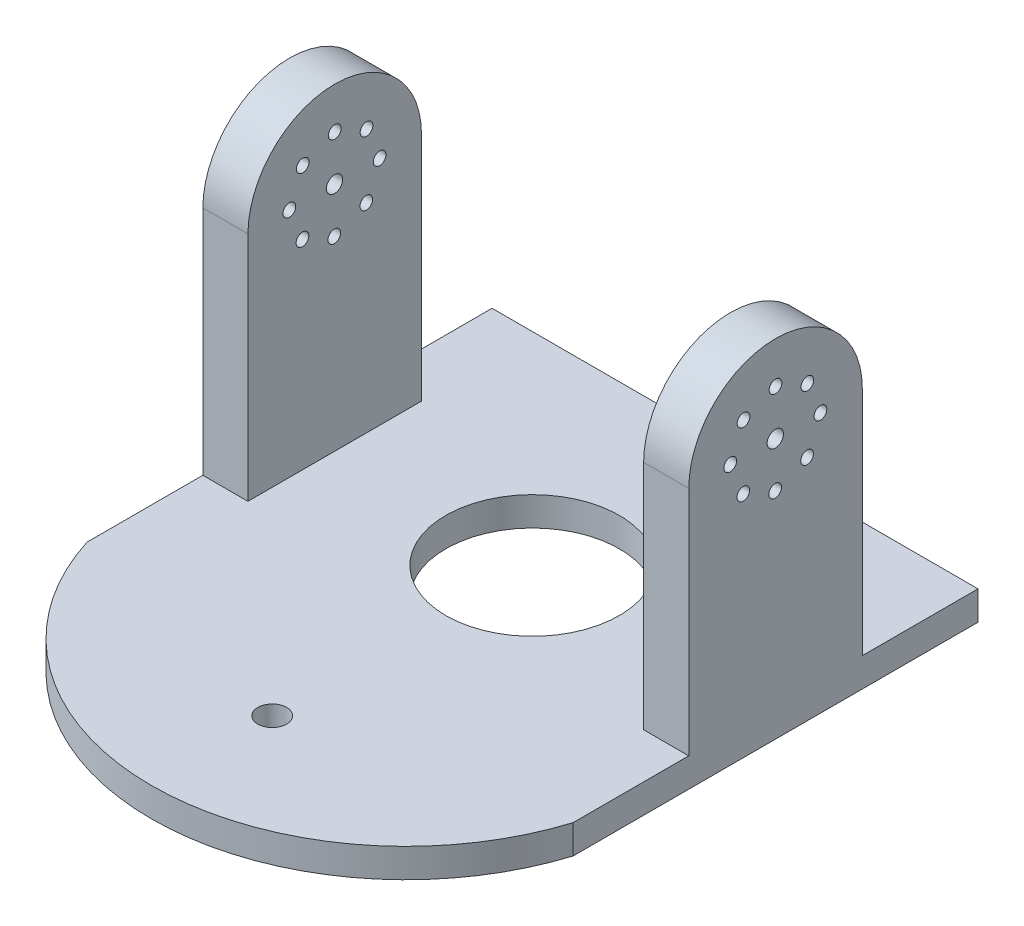
ISO-10303-21;
HEADER;
FILE_DESCRIPTION(('STEP AP214'),'2;1');
FILE_NAME('part.step','',(''),(''),'','','');
FILE_SCHEMA(('AUTOMOTIVE_DESIGN { 1 0 10303 214 1 1 1 1 }'));
ENDSEC;
DATA;
#1=APPLICATION_CONTEXT('core data for automotive mechanical design processes');
#2=APPLICATION_PROTOCOL_DEFINITION('international standard','automotive_design',2000,#1);
#3=PRODUCT_CONTEXT('',#1,'mechanical');
#4=PRODUCT('Part','Part','',(#3));
#5=PRODUCT_RELATED_PRODUCT_CATEGORY('part','',(#4));
#6=PRODUCT_DEFINITION_FORMATION('','',#4);
#7=PRODUCT_DEFINITION_CONTEXT('part definition',#1,'design');
#8=PRODUCT_DEFINITION('design','',#6,#7);
#9=PRODUCT_DEFINITION_SHAPE('','',#8);
#10=(LENGTH_UNIT() NAMED_UNIT(*) SI_UNIT(.MILLI.,.METRE.));
#11=(NAMED_UNIT(*) PLANE_ANGLE_UNIT() SI_UNIT($,.RADIAN.));
#12=(NAMED_UNIT(*) SI_UNIT($,.STERADIAN.) SOLID_ANGLE_UNIT());
#13=UNCERTAINTY_MEASURE_WITH_UNIT(LENGTH_MEASURE(1.E-05),#10,'distance_accuracy_value','');
#14=(GEOMETRIC_REPRESENTATION_CONTEXT(3) GLOBAL_UNCERTAINTY_ASSIGNED_CONTEXT((#13)) GLOBAL_UNIT_ASSIGNED_CONTEXT((#10,
#11,#12)) REPRESENTATION_CONTEXT('',''));
#15=CARTESIAN_POINT('',(0.,0.,0.));
#16=DIRECTION('',(0.,0.,1.));
#17=DIRECTION('',(1.,0.,0.));
#18=AXIS2_PLACEMENT_3D('',#15,#16,#17);
#19=CARTESIAN_POINT('',(-0.163176772911526,6.35,27.7941061482729));
#20=DIRECTION('',(0.,-1.,0.));
#21=DIRECTION('',(0.,0.,-1.));
#22=AXIS2_PLACEMENT_3D('',#19,#20,#21);
#23=PLANE('',#22);
#24=CARTESIAN_POINT('',(-0.163176772911548,6.35,0.));
#25=DIRECTION('',(0.,1.,0.));
#26=DIRECTION('',(0.,0.,1.));
#27=AXIS2_PLACEMENT_3D('',#24,#25,#26);
#28=CIRCLE('',#27,19.05);
#29=CARTESIAN_POINT('',(-0.163176772911548,6.35,19.05));
#30=VERTEX_POINT('',#29);
#31=EDGE_CURVE('E323',#30,#30,#28,.T.);
#32=ORIENTED_EDGE('',*,*,#31,.F.);
#33=EDGE_LOOP('',(#32));
#34=FACE_BOUND('',#33,.T.);
#35=CARTESIAN_POINT('',(-0.163176772911541,6.35,57.15));
#36=DIRECTION('',(0.,1.,0.));
#37=DIRECTION('',(0.,0.,1.));
#38=AXIS2_PLACEMENT_3D('',#35,#36,#37);
#39=CIRCLE('',#38,3.17499999999999);
#40=CARTESIAN_POINT('',(-0.163176772911541,6.35,60.325));
#41=VERTEX_POINT('',#40);
#42=EDGE_CURVE('E333',#41,#41,#39,.T.);
#43=ORIENTED_EDGE('',*,*,#42,.F.);
#44=EDGE_LOOP('',(#43));
#45=FACE_BOUND('',#44,.T.);
#46=DIRECTION('',(-1.,0.,0.));
#47=VECTOR('',#46,1.);
#48=CARTESIAN_POINT('',(53.1768232270885,6.35,-19.0500000000001));
#49=LINE('',#48,#47);
#50=CARTESIAN_POINT('',(53.1768232270885,6.35,-19.0500000000001));
#51=VERTEX_POINT('',#50);
#52=CARTESIAN_POINT('',(43.2708232270884,6.35,-19.0500000000001));
#53=VERTEX_POINT('',#52);
#54=EDGE_CURVE('E275',#51,#53,#49,.T.);
#55=ORIENTED_EDGE('',*,*,#54,.F.);
#56=DIRECTION('',(0.,0.,-1.));
#57=VECTOR('',#56,1.);
#58=CARTESIAN_POINT('',(53.1768232270885,6.35,-44.45));
#59=LINE('',#58,#57);
#60=CARTESIAN_POINT('',(53.1768232270885,6.35,-44.45));
#61=VERTEX_POINT('',#60);
#62=EDGE_CURVE('E287',#51,#61,#59,.T.);
#63=ORIENTED_EDGE('',*,*,#62,.T.);
#64=DIRECTION('',(-1.,0.,0.));
#65=VECTOR('',#64,1.);
#66=CARTESIAN_POINT('',(-53.5031767729115,6.35,-44.45));
#67=LINE('',#66,#65);
#68=CARTESIAN_POINT('',(-53.5031767729115,6.35,-44.45));
#69=VERTEX_POINT('',#68);
#70=EDGE_CURVE('E293',#61,#69,#67,.T.);
#71=ORIENTED_EDGE('',*,*,#70,.T.);
#72=DIRECTION('',(0.,0.,1.));
#73=VECTOR('',#72,1.);
#74=CARTESIAN_POINT('',(-53.5031767729115,6.35,-44.45));
#75=LINE('',#74,#73);
#76=CARTESIAN_POINT('',(-53.5031767729115,6.35,-19.05));
#77=VERTEX_POINT('',#76);
#78=EDGE_CURVE('E309',#69,#77,#75,.T.);
#79=ORIENTED_EDGE('',*,*,#78,.T.);
#80=DIRECTION('',(-1.,0.,0.));
#81=VECTOR('',#80,1.);
#82=CARTESIAN_POINT('',(-53.5031767729115,6.35,-19.05));
#83=LINE('',#82,#81);
#84=CARTESIAN_POINT('',(-43.5971767729116,6.35,-19.05));
#85=VERTEX_POINT('',#84);
#86=EDGE_CURVE('E159',#85,#77,#83,.T.);
#87=ORIENTED_EDGE('',*,*,#86,.F.);
#88=DIRECTION('',(0.,0.,-1.));
#89=VECTOR('',#88,1.);
#90=CARTESIAN_POINT('',(-43.5971767729116,6.35,-19.05));
#91=LINE('',#90,#89);
#92=CARTESIAN_POINT('',(-43.5971767729116,6.35,19.05));
#93=VERTEX_POINT('',#92);
#94=EDGE_CURVE('E156',#93,#85,#91,.T.);
#95=ORIENTED_EDGE('',*,*,#94,.F.);
#96=DIRECTION('',(1.,0.,0.));
#97=VECTOR('',#96,1.);
#98=CARTESIAN_POINT('',(-53.5031767729115,6.35,19.05));
#99=LINE('',#98,#97);
#100=CARTESIAN_POINT('',(-53.5031767729115,6.35,19.05));
#101=VERTEX_POINT('',#100);
#102=EDGE_CURVE('E155',#101,#93,#99,.T.);
#103=ORIENTED_EDGE('',*,*,#102,.F.);
#104=CARTESIAN_POINT('',(-53.5031767729115,6.35,44.45));
#105=VERTEX_POINT('',#104);
#106=EDGE_CURVE('E300',#101,#105,#75,.T.);
#107=ORIENTED_EDGE('',*,*,#106,.T.);
#108=CARTESIAN_POINT('',(-0.163176772911526,6.35,27.7941061482729));
#109=DIRECTION('',(0.,1.,0.));
#110=DIRECTION('',(0.,0.,-1.));
#111=AXIS2_PLACEMENT_3D('',#108,#109,#110);
#112=CIRCLE('',#111,55.88);
#113=CARTESIAN_POINT('',(53.1768232270885,6.35,44.45));
#114=VERTEX_POINT('',#113);
#115=EDGE_CURVE('E291',#105,#114,#112,.T.);
#116=ORIENTED_EDGE('',*,*,#115,.T.);
#117=CARTESIAN_POINT('',(53.1768232270885,6.35,19.0499999999999));
#118=VERTEX_POINT('',#117);
#119=EDGE_CURVE('E290',#114,#118,#59,.T.);
#120=ORIENTED_EDGE('',*,*,#119,.T.);
#121=DIRECTION('',(1.,0.,0.));
#122=VECTOR('',#121,1.);
#123=CARTESIAN_POINT('',(53.1768232270885,6.35,19.0499999999999));
#124=LINE('',#123,#122);
#125=CARTESIAN_POINT('',(43.2708232270884,6.35,19.0499999999999));
#126=VERTEX_POINT('',#125);
#127=EDGE_CURVE('E144',#126,#118,#124,.T.);
#128=ORIENTED_EDGE('',*,*,#127,.F.);
#129=DIRECTION('',(0.,0.,1.));
#130=VECTOR('',#129,1.);
#131=CARTESIAN_POINT('',(43.2708232270884,6.35,-19.0500000000001));
#132=LINE('',#131,#130);
#133=EDGE_CURVE('E149',#53,#126,#132,.T.);
#134=ORIENTED_EDGE('',*,*,#133,.F.);
#135=EDGE_LOOP('',(#55,#63,#71,#79,#87,#95,#103,#107,#116,#120,#128,#134));
#136=FACE_BOUND('',#135,.T.);
#137=ADVANCED_FACE('F33',(#34,#45,#136),#23,.F.);
#138=CARTESIAN_POINT('',(-0.163176772911526,0.,27.7941061482729));
#139=DIRECTION('',(0.,-1.,0.));
#140=DIRECTION('',(0.,0.,-1.));
#141=AXIS2_PLACEMENT_3D('',#138,#139,#140);
#142=PLANE('',#141);
#143=CARTESIAN_POINT('',(-0.163176772911548,0.,0.));
#144=DIRECTION('',(0.,1.,0.));
#145=DIRECTION('',(0.,0.,1.));
#146=AXIS2_PLACEMENT_3D('',#143,#144,#145);
#147=CIRCLE('',#146,19.05);
#148=CARTESIAN_POINT('',(-0.163176772911548,0.,19.05));
#149=VERTEX_POINT('',#148);
#150=EDGE_CURVE('E328',#149,#149,#147,.T.);
#151=ORIENTED_EDGE('',*,*,#150,.T.);
#152=EDGE_LOOP('',(#151));
#153=FACE_BOUND('',#152,.T.);
#154=CARTESIAN_POINT('',(-0.163176772911526,0.,27.7941061482729));
#155=DIRECTION('',(0.,1.,0.));
#156=DIRECTION('',(0.,0.,-1.));
#157=AXIS2_PLACEMENT_3D('',#154,#155,#156);
#158=CIRCLE('',#157,55.88);
#159=CARTESIAN_POINT('',(-53.5031767729115,0.,44.45));
#160=VERTEX_POINT('',#159);
#161=CARTESIAN_POINT('',(53.1768232270885,0.,44.45));
#162=VERTEX_POINT('',#161);
#163=EDGE_CURVE('E303',#160,#162,#158,.T.);
#164=ORIENTED_EDGE('',*,*,#163,.F.);
#165=DIRECTION('',(0.,0.,1.));
#166=VECTOR('',#165,1.);
#167=CARTESIAN_POINT('',(-53.5031767729115,0.,-44.45));
#168=LINE('',#167,#166);
#169=CARTESIAN_POINT('',(-53.5031767729115,0.,-44.45));
#170=VERTEX_POINT('',#169);
#171=EDGE_CURVE('E295',#170,#160,#168,.T.);
#172=ORIENTED_EDGE('',*,*,#171,.F.);
#173=DIRECTION('',(-1.,0.,0.));
#174=VECTOR('',#173,1.);
#175=CARTESIAN_POINT('',(-53.5031767729115,0.,-44.45));
#176=LINE('',#175,#174);
#177=CARTESIAN_POINT('',(53.1768232270885,0.,-44.45));
#178=VERTEX_POINT('',#177);
#179=EDGE_CURVE('E320',#178,#170,#176,.T.);
#180=ORIENTED_EDGE('',*,*,#179,.F.);
#181=DIRECTION('',(0.,0.,-1.));
#182=VECTOR('',#181,1.);
#183=CARTESIAN_POINT('',(53.1768232270885,0.,-44.45));
#184=LINE('',#183,#182);
#185=EDGE_CURVE('E321',#162,#178,#184,.T.);
#186=ORIENTED_EDGE('',*,*,#185,.F.);
#187=EDGE_LOOP('',(#164,#172,#180,#186));
#188=FACE_BOUND('',#187,.T.);
#189=CARTESIAN_POINT('',(-0.163176772911541,0.,57.15));
#190=DIRECTION('',(0.,1.,0.));
#191=DIRECTION('',(0.,0.,1.));
#192=AXIS2_PLACEMENT_3D('',#189,#190,#191);
#193=CIRCLE('',#192,3.17499999999999);
#194=CARTESIAN_POINT('',(-0.163176772911541,0.,60.325));
#195=VERTEX_POINT('',#194);
#196=EDGE_CURVE('E181',#195,#195,#193,.T.);
#197=ORIENTED_EDGE('',*,*,#196,.T.);
#198=EDGE_LOOP('',(#197));
#199=FACE_BOUND('',#198,.T.);
#200=ADVANCED_FACE('F365',(#153,#188,#199),#142,.T.);
#201=CARTESIAN_POINT('',(-0.163176772911526,6.35,27.7941061482729));
#202=DIRECTION('',(0.,-1.,0.));
#203=DIRECTION('',(0.,0.,-1.));
#204=AXIS2_PLACEMENT_3D('',#201,#202,#203);
#205=CYLINDRICAL_SURFACE('',#204,55.88);
#206=ORIENTED_EDGE('',*,*,#163,.T.);
#207=DIRECTION('',(0.,-1.,0.));
#208=VECTOR('',#207,1.);
#209=CARTESIAN_POINT('',(53.1768232270885,6.35,44.45));
#210=LINE('',#209,#208);
#211=EDGE_CURVE('E11',#114,#162,#210,.T.);
#212=ORIENTED_EDGE('',*,*,#211,.F.);
#213=ORIENTED_EDGE('',*,*,#115,.F.);
#214=DIRECTION('',(0.,-1.,0.));
#215=VECTOR('',#214,1.);
#216=CARTESIAN_POINT('',(-53.5031767729115,6.35,44.45));
#217=LINE('',#216,#215);
#218=EDGE_CURVE('E311',#105,#160,#217,.T.);
#219=ORIENTED_EDGE('',*,*,#218,.T.);
#220=EDGE_LOOP('',(#206,#212,#213,#219));
#221=FACE_BOUND('',#220,.T.);
#222=ADVANCED_FACE('F35',(#221),#205,.T.);
#223=CARTESIAN_POINT('',(53.1768232270885,6.35,-44.45));
#224=DIRECTION('',(-1.,0.,0.));
#225=DIRECTION('',(0.,0.,1.));
#226=AXIS2_PLACEMENT_3D('',#223,#224,#225);
#227=PLANE('',#226);
#228=CARTESIAN_POINT('',(53.1768232270885,57.15,0.0447929927483846));
#229=DIRECTION('',(-1.,0.,0.));
#230=DIRECTION('',(0.,0.,1.));
#231=AXIS2_PLACEMENT_3D('',#228,#229,#230);
#232=CIRCLE('',#231,1.7859375);
#233=CARTESIAN_POINT('',(53.1768232270885,57.15,1.83073049274839));
#234=VERTEX_POINT('',#233);
#235=EDGE_CURVE('E392',#234,#234,#232,.T.);
#236=ORIENTED_EDGE('',*,*,#235,.T.);
#237=EDGE_LOOP('',(#236));
#238=FACE_BOUND('',#237,.T.);
#239=CARTESIAN_POINT('',(53.1768232270885,57.1052070072516,-9.86120700725161));
#240=DIRECTION('',(-1.,0.,0.));
#241=DIRECTION('',(0.,0.,1.));
#242=AXIS2_PLACEMENT_3D('',#239,#240,#241);
#243=CIRCLE('',#242,1.397);
#244=CARTESIAN_POINT('',(53.1768232270885,57.1052070072516,-8.46420700725161));
#245=VERTEX_POINT('',#244);
#246=EDGE_CURVE('E186',#245,#245,#243,.T.);
#247=ORIENTED_EDGE('',*,*,#246,.T.);
#248=EDGE_LOOP('',(#247));
#249=FACE_BOUND('',#248,.T.);
#250=CARTESIAN_POINT('',(53.1768232270885,50.1137267966441,-6.92813335276361));
#251=DIRECTION('',(-1.,0.,0.));
#252=DIRECTION('',(0.,0.,1.));
#253=AXIS2_PLACEMENT_3D('',#250,#251,#252);
#254=CIRCLE('',#253,1.397);
#255=CARTESIAN_POINT('',(53.1768232270885,50.1137267966441,-5.53113335276361));
#256=VERTEX_POINT('',#255);
#257=EDGE_CURVE('E208',#256,#256,#254,.T.);
#258=ORIENTED_EDGE('',*,*,#257,.T.);
#259=EDGE_LOOP('',(#258));
#260=FACE_BOUND('',#259,.T.);
#261=CARTESIAN_POINT('',(53.1768232270885,47.244,0.0895859854966798));
#262=DIRECTION('',(-1.,0.,0.));
#263=DIRECTION('',(0.,0.,1.));
#264=AXIS2_PLACEMENT_3D('',#261,#262,#263);
#265=CIRCLE('',#264,1.397);
#266=CARTESIAN_POINT('',(53.1768232270885,47.244,1.48658598549668));
#267=VERTEX_POINT('',#266);
#268=EDGE_CURVE('E217',#267,#267,#265,.T.);
#269=ORIENTED_EDGE('',*,*,#268,.T.);
#270=EDGE_LOOP('',(#269));
#271=FACE_BOUND('',#270,.T.);
#272=CARTESIAN_POINT('',(53.1768232270885,50.177073654488,7.0810661961043));
#273=DIRECTION('',(-1.,0.,0.));
#274=DIRECTION('',(0.,0.,1.));
#275=AXIS2_PLACEMENT_3D('',#272,#273,#274);
#276=CIRCLE('',#275,1.397);
#277=CARTESIAN_POINT('',(53.1768232270885,50.177073654488,8.4780661961043));
#278=VERTEX_POINT('',#277);
#279=EDGE_CURVE('E227',#278,#278,#276,.T.);
#280=ORIENTED_EDGE('',*,*,#279,.T.);
#281=EDGE_LOOP('',(#280));
#282=FACE_BOUND('',#281,.T.);
#283=CARTESIAN_POINT('',(53.1768232270885,57.1947929927483,9.95079299274838));
#284=DIRECTION('',(-1.,0.,0.));
#285=DIRECTION('',(0.,0.,1.));
#286=AXIS2_PLACEMENT_3D('',#283,#284,#285);
#287=CIRCLE('',#286,1.397);
#288=CARTESIAN_POINT('',(53.1768232270885,57.1947929927483,11.3477929927484));
#289=VERTEX_POINT('',#288);
#290=EDGE_CURVE('E237',#289,#289,#287,.T.);
#291=ORIENTED_EDGE('',*,*,#290,.T.);
#292=EDGE_LOOP('',(#291));
#293=FACE_BOUND('',#292,.T.);
#294=CARTESIAN_POINT('',(53.1768232270885,64.1862732033559,7.01771933826033));
#295=DIRECTION('',(-1.,0.,0.));
#296=DIRECTION('',(0.,0.,1.));
#297=AXIS2_PLACEMENT_3D('',#294,#295,#296);
#298=CIRCLE('',#297,1.397);
#299=CARTESIAN_POINT('',(53.1768232270885,64.1862732033559,8.41471933826034));
#300=VERTEX_POINT('',#299);
#301=EDGE_CURVE('E247',#300,#300,#298,.T.);
#302=ORIENTED_EDGE('',*,*,#301,.T.);
#303=EDGE_LOOP('',(#302));
#304=FACE_BOUND('',#303,.T.);
#305=CARTESIAN_POINT('',(53.1768232270885,67.056,0.));
#306=DIRECTION('',(-1.,0.,0.));
#307=DIRECTION('',(0.,0.,1.));
#308=AXIS2_PLACEMENT_3D('',#305,#306,#307);
#309=CIRCLE('',#308,1.397);
#310=CARTESIAN_POINT('',(53.1768232270885,67.056,1.39700000000002));
#311=VERTEX_POINT('',#310);
#312=EDGE_CURVE('E257',#311,#311,#309,.T.);
#313=ORIENTED_EDGE('',*,*,#312,.T.);
#314=EDGE_LOOP('',(#313));
#315=FACE_BOUND('',#314,.T.);
#316=CARTESIAN_POINT('',(53.1768232270885,64.1229263455119,-6.99148021060757));
#317=DIRECTION('',(-1.,0.,0.));
#318=DIRECTION('',(0.,0.,1.));
#319=AXIS2_PLACEMENT_3D('',#316,#317,#318);
#320=CIRCLE('',#319,1.397);
#321=CARTESIAN_POINT('',(53.1768232270885,64.1229263455119,-5.59448021060756));
#322=VERTEX_POINT('',#321);
#323=EDGE_CURVE('E267',#322,#322,#320,.T.);
#324=ORIENTED_EDGE('',*,*,#323,.T.);
#325=EDGE_LOOP('',(#324));
#326=FACE_BOUND('',#325,.T.);
#327=DIRECTION('',(0.,-1.,0.));
#328=VECTOR('',#327,1.);
#329=CARTESIAN_POINT('',(53.1768232270885,82.55,-19.0500000000001));
#330=LINE('',#329,#328);
#331=CARTESIAN_POINT('',(53.1768232270885,57.1052070072516,-19.05));
#332=VERTEX_POINT('',#331);
#333=EDGE_CURVE('E138',#332,#51,#330,.T.);
#334=ORIENTED_EDGE('',*,*,#333,.F.);
#335=CARTESIAN_POINT('',(53.1768232270885,57.1052070072516,0.000105323475013719));
#336=DIRECTION('',(1.,0.,0.));
#337=DIRECTION('',(0.,0.,-1.));
#338=AXIS2_PLACEMENT_3D('',#335,#336,#337);
#339=CIRCLE('',#338,19.050105323475);
#340=CARTESIAN_POINT('',(53.1768232270885,57.1947929927483,19.05));
#341=VERTEX_POINT('',#340);
#342=EDGE_CURVE('E124',#332,#341,#339,.T.);
#343=ORIENTED_EDGE('',*,*,#342,.T.);
#344=DIRECTION('',(0.,-1.,0.));
#345=VECTOR('',#344,1.);
#346=CARTESIAN_POINT('',(53.1768232270885,82.55,19.0499999999999));
#347=LINE('',#346,#345);
#348=EDGE_CURVE('E135',#341,#118,#347,.T.);
#349=ORIENTED_EDGE('',*,*,#348,.T.);
#350=ORIENTED_EDGE('',*,*,#119,.F.);
#351=ORIENTED_EDGE('',*,*,#211,.T.);
#352=ORIENTED_EDGE('',*,*,#185,.T.);
#353=DIRECTION('',(0.,-1.,0.));
#354=VECTOR('',#353,1.);
#355=CARTESIAN_POINT('',(53.1768232270885,6.35,-44.45));
#356=LINE('',#355,#354);
#357=EDGE_CURVE('E42',#61,#178,#356,.T.);
#358=ORIENTED_EDGE('',*,*,#357,.F.);
#359=ORIENTED_EDGE('',*,*,#62,.F.);
#360=EDGE_LOOP('',(#334,#343,#349,#350,#351,#352,#358,#359));
#361=FACE_BOUND('',#360,.T.);
#362=ADVANCED_FACE('F134',(#238,#249,#260,#271,#282,#293,#304,#315,#326,#361),#227,.F.);
#363=CARTESIAN_POINT('',(-53.5031767729115,6.35,-44.45));
#364=DIRECTION('',(0.,0.,1.));
#365=DIRECTION('',(1.,0.,0.));
#366=AXIS2_PLACEMENT_3D('',#363,#364,#365);
#367=PLANE('',#366);
#368=ORIENTED_EDGE('',*,*,#179,.T.);
#369=DIRECTION('',(0.,-1.,0.));
#370=VECTOR('',#369,1.);
#371=CARTESIAN_POINT('',(-53.5031767729115,6.35,-44.45));
#372=LINE('',#371,#370);
#373=EDGE_CURVE('E314',#69,#170,#372,.T.);
#374=ORIENTED_EDGE('',*,*,#373,.F.);
#375=ORIENTED_EDGE('',*,*,#70,.F.);
#376=ORIENTED_EDGE('',*,*,#357,.T.);
#377=EDGE_LOOP('',(#368,#374,#375,#376));
#378=FACE_BOUND('',#377,.T.);
#379=ADVANCED_FACE('F381',(#378),#367,.F.);
#380=CARTESIAN_POINT('',(-53.5031767729115,6.35,-44.45));
#381=DIRECTION('',(1.,0.,0.));
#382=DIRECTION('',(0.,0.,-1.));
#383=AXIS2_PLACEMENT_3D('',#380,#381,#382);
#384=PLANE('',#383);
#385=CARTESIAN_POINT('',(-53.5031767729115,57.15,0.0447929927483992));
#386=DIRECTION('',(-1.,0.,0.));
#387=DIRECTION('',(0.,0.,1.));
#388=AXIS2_PLACEMENT_3D('',#385,#386,#387);
#389=CIRCLE('',#388,1.7859375);
#390=CARTESIAN_POINT('',(-53.5031767729115,57.15,1.8307304927484));
#391=VERTEX_POINT('',#390);
#392=EDGE_CURVE('E478',#391,#391,#389,.T.);
#393=ORIENTED_EDGE('',*,*,#392,.F.);
#394=EDGE_LOOP('',(#393));
#395=FACE_BOUND('',#394,.T.);
#396=CARTESIAN_POINT('',(-53.5031767729115,57.1052070072516,-9.8612070072516));
#397=DIRECTION('',(-1.,0.,0.));
#398=DIRECTION('',(0.,0.,1.));
#399=AXIS2_PLACEMENT_3D('',#396,#397,#398);
#400=CIRCLE('',#399,1.397);
#401=CARTESIAN_POINT('',(-53.5031767729115,57.1052070072516,-8.4642070072516));
#402=VERTEX_POINT('',#401);
#403=EDGE_CURVE('E192',#402,#402,#400,.T.);
#404=ORIENTED_EDGE('',*,*,#403,.F.);
#405=EDGE_LOOP('',(#404));
#406=FACE_BOUND('',#405,.T.);
#407=CARTESIAN_POINT('',(-53.5031767729115,50.1137267966441,-6.92813335276359));
#408=DIRECTION('',(-1.,0.,0.));
#409=DIRECTION('',(0.,0.,1.));
#410=AXIS2_PLACEMENT_3D('',#407,#408,#409);
#411=CIRCLE('',#410,1.397);
#412=CARTESIAN_POINT('',(-53.5031767729115,50.1137267966441,-5.53113335276359));
#413=VERTEX_POINT('',#412);
#414=EDGE_CURVE('E207',#413,#413,#411,.T.);
#415=ORIENTED_EDGE('',*,*,#414,.F.);
#416=EDGE_LOOP('',(#415));
#417=FACE_BOUND('',#416,.T.);
#418=CARTESIAN_POINT('',(-53.5031767729115,47.244,0.0895859854966943));
#419=DIRECTION('',(-1.,0.,0.));
#420=DIRECTION('',(0.,0.,1.));
#421=AXIS2_PLACEMENT_3D('',#418,#419,#420);
#422=CIRCLE('',#421,1.397);
#423=CARTESIAN_POINT('',(-53.5031767729115,47.244,1.4865859854967));
#424=VERTEX_POINT('',#423);
#425=EDGE_CURVE('E216',#424,#424,#422,.T.);
#426=ORIENTED_EDGE('',*,*,#425,.F.);
#427=EDGE_LOOP('',(#426));
#428=FACE_BOUND('',#427,.T.);
#429=CARTESIAN_POINT('',(-53.5031767729115,50.177073654488,7.08106619610432));
#430=DIRECTION('',(-1.,0.,0.));
#431=DIRECTION('',(0.,0.,1.));
#432=AXIS2_PLACEMENT_3D('',#429,#430,#431);
#433=CIRCLE('',#432,1.397);
#434=CARTESIAN_POINT('',(-53.5031767729115,50.177073654488,8.47806619610432));
#435=VERTEX_POINT('',#434);
#436=EDGE_CURVE('E226',#435,#435,#433,.T.);
#437=ORIENTED_EDGE('',*,*,#436,.F.);
#438=EDGE_LOOP('',(#437));
#439=FACE_BOUND('',#438,.T.);
#440=CARTESIAN_POINT('',(-53.5031767729115,57.1947929927483,9.9507929927484));
#441=DIRECTION('',(-1.,0.,0.));
#442=DIRECTION('',(0.,0.,1.));
#443=AXIS2_PLACEMENT_3D('',#440,#441,#442);
#444=CIRCLE('',#443,1.397);
#445=CARTESIAN_POINT('',(-53.5031767729115,57.1947929927483,11.3477929927484));
#446=VERTEX_POINT('',#445);
#447=EDGE_CURVE('E236',#446,#446,#444,.T.);
#448=ORIENTED_EDGE('',*,*,#447,.F.);
#449=EDGE_LOOP('',(#448));
#450=FACE_BOUND('',#449,.T.);
#451=CARTESIAN_POINT('',(-53.5031767729115,64.1862732033559,7.01771933826035));
#452=DIRECTION('',(-1.,0.,0.));
#453=DIRECTION('',(0.,0.,1.));
#454=AXIS2_PLACEMENT_3D('',#451,#452,#453);
#455=CIRCLE('',#454,1.397);
#456=CARTESIAN_POINT('',(-53.5031767729115,64.1862732033559,8.41471933826035));
#457=VERTEX_POINT('',#456);
#458=EDGE_CURVE('E246',#457,#457,#455,.T.);
#459=ORIENTED_EDGE('',*,*,#458,.F.);
#460=EDGE_LOOP('',(#459));
#461=FACE_BOUND('',#460,.T.);
#462=CARTESIAN_POINT('',(-53.5031767729115,67.056,0.));
#463=DIRECTION('',(-1.,0.,0.));
#464=DIRECTION('',(0.,0.,1.));
#465=AXIS2_PLACEMENT_3D('',#462,#463,#464);
#466=CIRCLE('',#465,1.397);
#467=CARTESIAN_POINT('',(-53.5031767729115,67.056,1.39700000000003));
#468=VERTEX_POINT('',#467);
#469=EDGE_CURVE('E256',#468,#468,#466,.T.);
#470=ORIENTED_EDGE('',*,*,#469,.F.);
#471=EDGE_LOOP('',(#470));
#472=FACE_BOUND('',#471,.T.);
#473=CARTESIAN_POINT('',(-53.5031767729115,64.1229263455119,-6.99148021060755));
#474=DIRECTION('',(-1.,0.,0.));
#475=DIRECTION('',(0.,0.,1.));
#476=AXIS2_PLACEMENT_3D('',#473,#474,#475);
#477=CIRCLE('',#476,1.397);
#478=CARTESIAN_POINT('',(-53.5031767729115,64.1229263455119,-5.59448021060755));
#479=VERTEX_POINT('',#478);
#480=EDGE_CURVE('E266',#479,#479,#477,.T.);
#481=ORIENTED_EDGE('',*,*,#480,.F.);
#482=EDGE_LOOP('',(#481));
#483=FACE_BOUND('',#482,.T.);
#484=DIRECTION('',(0.,-1.,0.));
#485=VECTOR('',#484,1.);
#486=CARTESIAN_POINT('',(-53.5031767729115,82.55,19.05));
#487=LINE('',#486,#485);
#488=CARTESIAN_POINT('',(-53.5031767729115,57.1947929927483,19.05));
#489=VERTEX_POINT('',#488);
#490=EDGE_CURVE('E180',#489,#101,#487,.T.);
#491=ORIENTED_EDGE('',*,*,#490,.F.);
#492=CARTESIAN_POINT('',(-53.5031767729115,57.1052070072516,0.000105323475028291));
#493=DIRECTION('',(1.,0.,0.));
#494=DIRECTION('',(0.,0.,-1.));
#495=AXIS2_PLACEMENT_3D('',#492,#493,#494);
#496=CIRCLE('',#495,19.050105323475);
#497=CARTESIAN_POINT('',(-53.5031767729115,57.1052070072516,-19.05));
#498=VERTEX_POINT('',#497);
#499=EDGE_CURVE('E139',#498,#489,#496,.T.);
#500=ORIENTED_EDGE('',*,*,#499,.F.);
#501=DIRECTION('',(0.,-1.,0.));
#502=VECTOR('',#501,1.);
#503=CARTESIAN_POINT('',(-53.5031767729115,82.55,-19.05));
#504=LINE('',#503,#502);
#505=EDGE_CURVE('E168',#498,#77,#504,.T.);
#506=ORIENTED_EDGE('',*,*,#505,.T.);
#507=ORIENTED_EDGE('',*,*,#78,.F.);
#508=ORIENTED_EDGE('',*,*,#373,.T.);
#509=ORIENTED_EDGE('',*,*,#171,.T.);
#510=ORIENTED_EDGE('',*,*,#218,.F.);
#511=ORIENTED_EDGE('',*,*,#106,.F.);
#512=EDGE_LOOP('',(#491,#500,#506,#507,#508,#509,#510,#511));
#513=FACE_BOUND('',#512,.T.);
#514=ADVANCED_FACE('F378',(#395,#406,#417,#428,#439,#450,#461,#472,#483,#513),#384,.F.);
#515=CARTESIAN_POINT('',(-0.163176772911548,6.35,0.));
#516=DIRECTION('',(0.,-1.,0.));
#517=DIRECTION('',(0.,0.,-1.));
#518=AXIS2_PLACEMENT_3D('',#515,#516,#517);
#519=CYLINDRICAL_SURFACE('',#518,19.05);
#520=ORIENTED_EDGE('',*,*,#31,.T.);
#521=EDGE_LOOP('',(#520));
#522=FACE_BOUND('',#521,.T.);
#523=ORIENTED_EDGE('',*,*,#150,.F.);
#524=EDGE_LOOP('',(#523));
#525=FACE_BOUND('',#524,.T.);
#526=ADVANCED_FACE('F375',(#522,#525),#519,.F.);
#527=CARTESIAN_POINT('',(-0.163176772911541,6.35,57.15));
#528=DIRECTION('',(0.,-1.,0.));
#529=DIRECTION('',(0.,0.,-1.));
#530=AXIS2_PLACEMENT_3D('',#527,#528,#529);
#531=CYLINDRICAL_SURFACE('',#530,3.17499999999999);
#532=ORIENTED_EDGE('',*,*,#42,.T.);
#533=EDGE_LOOP('',(#532));
#534=FACE_BOUND('',#533,.T.);
#535=ORIENTED_EDGE('',*,*,#196,.F.);
#536=EDGE_LOOP('',(#535));
#537=FACE_BOUND('',#536,.T.);
#538=ADVANCED_FACE('F359',(#534,#537),#531,.F.);
#539=CARTESIAN_POINT('',(-53.5031767729115,82.55,19.05));
#540=DIRECTION('',(0.,0.,-1.));
#541=DIRECTION('',(-1.,0.,0.));
#542=AXIS2_PLACEMENT_3D('',#539,#540,#541);
#543=PLANE('',#542);
#544=DIRECTION('',(0.,-1.,0.));
#545=VECTOR('',#544,1.);
#546=CARTESIAN_POINT('',(-43.5971767729116,82.55,19.05));
#547=LINE('',#546,#545);
#548=CARTESIAN_POINT('',(-43.5971767729116,57.1947929927483,19.05));
#549=VERTEX_POINT('',#548);
#550=EDGE_CURVE('E182',#549,#93,#547,.T.);
#551=ORIENTED_EDGE('',*,*,#550,.F.);
#552=DIRECTION('',(-1.,0.,0.));
#553=VECTOR('',#552,1.);
#554=CARTESIAN_POINT('',(53.1768232270885,57.1947929927483,19.05));
#555=LINE('',#554,#553);
#556=EDGE_CURVE('E130',#549,#489,#555,.T.);
#557=ORIENTED_EDGE('',*,*,#556,.T.);
#558=ORIENTED_EDGE('',*,*,#490,.T.);
#559=ORIENTED_EDGE('',*,*,#102,.T.);
#560=EDGE_LOOP('',(#551,#557,#558,#559));
#561=FACE_BOUND('',#560,.T.);
#562=ADVANCED_FACE('F351',(#561),#543,.F.);
#563=CARTESIAN_POINT('',(-43.5971767729116,82.55,-19.05));
#564=DIRECTION('',(-1.,0.,0.));
#565=DIRECTION('',(0.,0.,1.));
#566=AXIS2_PLACEMENT_3D('',#563,#564,#565);
#567=PLANE('',#566);
#568=CARTESIAN_POINT('',(-43.5971767729116,57.15,0.0447929927483979));
#569=DIRECTION('',(-1.,0.,0.));
#570=DIRECTION('',(0.,0.,1.));
#571=AXIS2_PLACEMENT_3D('',#568,#569,#570);
#572=CIRCLE('',#571,1.7859375);
#573=CARTESIAN_POINT('',(-43.5971767729116,57.15,1.8307304927484));
#574=VERTEX_POINT('',#573);
#575=EDGE_CURVE('E197',#574,#574,#572,.T.);
#576=ORIENTED_EDGE('',*,*,#575,.T.);
#577=EDGE_LOOP('',(#576));
#578=FACE_BOUND('',#577,.T.);
#579=CARTESIAN_POINT('',(-43.5971767729116,57.1052070072516,-9.8612070072516));
#580=DIRECTION('',(-1.,0.,0.));
#581=DIRECTION('',(0.,0.,1.));
#582=AXIS2_PLACEMENT_3D('',#579,#580,#581);
#583=CIRCLE('',#582,1.397);
#584=CARTESIAN_POINT('',(-43.5971767729116,57.1052070072516,-8.4642070072516));
#585=VERTEX_POINT('',#584);
#586=EDGE_CURVE('E185',#585,#585,#583,.T.);
#587=ORIENTED_EDGE('',*,*,#586,.T.);
#588=EDGE_LOOP('',(#587));
#589=FACE_BOUND('',#588,.T.);
#590=CARTESIAN_POINT('',(-43.5971767729116,50.1137267966441,-6.92813335276359));
#591=DIRECTION('',(-1.,0.,0.));
#592=DIRECTION('',(0.,0.,1.));
#593=AXIS2_PLACEMENT_3D('',#590,#591,#592);
#594=CIRCLE('',#593,1.397);
#595=CARTESIAN_POINT('',(-43.5971767729116,50.1137267966441,-5.5311333527636));
#596=VERTEX_POINT('',#595);
#597=EDGE_CURVE('E213',#596,#596,#594,.T.);
#598=ORIENTED_EDGE('',*,*,#597,.T.);
#599=EDGE_LOOP('',(#598));
#600=FACE_BOUND('',#599,.T.);
#601=CARTESIAN_POINT('',(-43.5971767729116,47.244,0.089585985496693));
#602=DIRECTION('',(-1.,0.,0.));
#603=DIRECTION('',(0.,0.,1.));
#604=AXIS2_PLACEMENT_3D('',#601,#602,#603);
#605=CIRCLE('',#604,1.397);
#606=CARTESIAN_POINT('',(-43.5971767729116,47.244,1.48658598549669));
#607=VERTEX_POINT('',#606);
#608=EDGE_CURVE('E223',#607,#607,#605,.T.);
#609=ORIENTED_EDGE('',*,*,#608,.T.);
#610=EDGE_LOOP('',(#609));
#611=FACE_BOUND('',#610,.T.);
#612=CARTESIAN_POINT('',(-43.5971767729116,50.177073654488,7.08106619610432));
#613=DIRECTION('',(-1.,0.,0.));
#614=DIRECTION('',(0.,0.,1.));
#615=AXIS2_PLACEMENT_3D('',#612,#613,#614);
#616=CIRCLE('',#615,1.397);
#617=CARTESIAN_POINT('',(-43.5971767729116,50.177073654488,8.47806619610432));
#618=VERTEX_POINT('',#617);
#619=EDGE_CURVE('E233',#618,#618,#616,.T.);
#620=ORIENTED_EDGE('',*,*,#619,.T.);
#621=EDGE_LOOP('',(#620));
#622=FACE_BOUND('',#621,.T.);
#623=CARTESIAN_POINT('',(-43.5971767729116,57.1947929927483,9.9507929927484));
#624=DIRECTION('',(-1.,0.,0.));
#625=DIRECTION('',(0.,0.,1.));
#626=AXIS2_PLACEMENT_3D('',#623,#624,#625);
#627=CIRCLE('',#626,1.397);
#628=CARTESIAN_POINT('',(-43.5971767729116,57.1947929927483,11.3477929927484));
#629=VERTEX_POINT('',#628);
#630=EDGE_CURVE('E243',#629,#629,#627,.T.);
#631=ORIENTED_EDGE('',*,*,#630,.T.);
#632=EDGE_LOOP('',(#631));
#633=FACE_BOUND('',#632,.T.);
#634=CARTESIAN_POINT('',(-43.5971767729116,64.1862732033559,7.01771933826035));
#635=DIRECTION('',(-1.,0.,0.));
#636=DIRECTION('',(0.,0.,1.));
#637=AXIS2_PLACEMENT_3D('',#634,#635,#636);
#638=CIRCLE('',#637,1.397);
#639=CARTESIAN_POINT('',(-43.5971767729116,64.1862732033559,8.41471933826035));
#640=VERTEX_POINT('',#639);
#641=EDGE_CURVE('E253',#640,#640,#638,.T.);
#642=ORIENTED_EDGE('',*,*,#641,.T.);
#643=EDGE_LOOP('',(#642));
#644=FACE_BOUND('',#643,.T.);
#645=CARTESIAN_POINT('',(-43.5971767729116,67.056,0.));
#646=DIRECTION('',(-1.,0.,0.));
#647=DIRECTION('',(0.,0.,1.));
#648=AXIS2_PLACEMENT_3D('',#645,#646,#647);
#649=CIRCLE('',#648,1.397);
#650=CARTESIAN_POINT('',(-43.5971767729116,67.056,1.39700000000003));
#651=VERTEX_POINT('',#650);
#652=EDGE_CURVE('E263',#651,#651,#649,.T.);
#653=ORIENTED_EDGE('',*,*,#652,.T.);
#654=EDGE_LOOP('',(#653));
#655=FACE_BOUND('',#654,.T.);
#656=CARTESIAN_POINT('',(-43.5971767729116,64.1229263455119,-6.99148021060756));
#657=DIRECTION('',(-1.,0.,0.));
#658=DIRECTION('',(0.,0.,1.));
#659=AXIS2_PLACEMENT_3D('',#656,#657,#658);
#660=CIRCLE('',#659,1.397);
#661=CARTESIAN_POINT('',(-43.5971767729116,64.1229263455119,-5.59448021060755));
#662=VERTEX_POINT('',#661);
#663=EDGE_CURVE('E272',#662,#662,#660,.T.);
#664=ORIENTED_EDGE('',*,*,#663,.T.);
#665=EDGE_LOOP('',(#664));
#666=FACE_BOUND('',#665,.T.);
#667=DIRECTION('',(0.,-1.,0.));
#668=VECTOR('',#667,1.);
#669=CARTESIAN_POINT('',(-43.5971767729116,82.55,-19.05));
#670=LINE('',#669,#668);
#671=CARTESIAN_POINT('',(-43.5971767729116,57.1052070072516,-19.05));
#672=VERTEX_POINT('',#671);
#673=EDGE_CURVE('E162',#672,#85,#670,.T.);
#674=ORIENTED_EDGE('',*,*,#673,.F.);
#675=CARTESIAN_POINT('',(-43.5971767729116,57.1052070072516,0.000105323475026938));
#676=DIRECTION('',(-1.,0.,0.));
#677=DIRECTION('',(0.,0.,1.));
#678=AXIS2_PLACEMENT_3D('',#675,#676,#677);
#679=CIRCLE('',#678,19.050105323475);
#680=EDGE_CURVE('E50',#672,#549,#679,.F.);
#681=ORIENTED_EDGE('',*,*,#680,.T.);
#682=ORIENTED_EDGE('',*,*,#550,.T.);
#683=ORIENTED_EDGE('',*,*,#94,.T.);
#684=EDGE_LOOP('',(#674,#681,#682,#683));
#685=FACE_BOUND('',#684,.T.);
#686=ADVANCED_FACE('F349',(#578,#589,#600,#611,#622,#633,#644,#655,#666,#685),#567,.F.);
#687=CARTESIAN_POINT('',(-53.5031767729115,82.55,-19.05));
#688=DIRECTION('',(0.,0.,1.));
#689=DIRECTION('',(1.,0.,0.));
#690=AXIS2_PLACEMENT_3D('',#687,#688,#689);
#691=PLANE('',#690);
#692=ORIENTED_EDGE('',*,*,#505,.F.);
#693=DIRECTION('',(-1.,0.,0.));
#694=VECTOR('',#693,1.);
#695=CARTESIAN_POINT('',(53.1768232270885,57.1052070072516,-19.05));
#696=LINE('',#695,#694);
#697=EDGE_CURVE('E129',#672,#498,#696,.T.);
#698=ORIENTED_EDGE('',*,*,#697,.F.);
#699=ORIENTED_EDGE('',*,*,#673,.T.);
#700=ORIENTED_EDGE('',*,*,#86,.T.);
#701=EDGE_LOOP('',(#692,#698,#699,#700));
#702=FACE_BOUND('',#701,.T.);
#703=ADVANCED_FACE('F345',(#702),#691,.F.);
#704=CARTESIAN_POINT('',(53.1768232270885,82.55,-19.0500000000001));
#705=DIRECTION('',(0.,0.,1.));
#706=DIRECTION('',(1.,0.,0.));
#707=AXIS2_PLACEMENT_3D('',#704,#705,#706);
#708=PLANE('',#707);
#709=DIRECTION('',(0.,-1.,0.));
#710=VECTOR('',#709,1.);
#711=CARTESIAN_POINT('',(43.2708232270884,82.55,-19.0500000000001));
#712=LINE('',#711,#710);
#713=CARTESIAN_POINT('',(43.2708232270884,57.1052070072516,-19.05));
#714=VERTEX_POINT('',#713);
#715=EDGE_CURVE('E147',#714,#53,#712,.T.);
#716=ORIENTED_EDGE('',*,*,#715,.F.);
#717=EDGE_CURVE('E203',#332,#714,#696,.T.);
#718=ORIENTED_EDGE('',*,*,#717,.F.);
#719=ORIENTED_EDGE('',*,*,#333,.T.);
#720=ORIENTED_EDGE('',*,*,#54,.T.);
#721=EDGE_LOOP('',(#716,#718,#719,#720));
#722=FACE_BOUND('',#721,.T.);
#723=ADVANCED_FACE('F285',(#722),#708,.F.);
#724=CARTESIAN_POINT('',(43.2708232270884,82.55,-19.0500000000001));
#725=DIRECTION('',(1.,0.,0.));
#726=DIRECTION('',(0.,0.,-1.));
#727=AXIS2_PLACEMENT_3D('',#724,#725,#726);
#728=PLANE('',#727);
#729=CARTESIAN_POINT('',(43.2708232270884,57.15,0.044792992748386));
#730=DIRECTION('',(1.,0.,0.));
#731=DIRECTION('',(0.,0.,-1.));
#732=AXIS2_PLACEMENT_3D('',#729,#730,#731);
#733=CIRCLE('',#732,1.7859375);
#734=CARTESIAN_POINT('',(43.2708232270884,57.15,-1.74114450725161));
#735=VERTEX_POINT('',#734);
#736=EDGE_CURVE('E37',#735,#735,#733,.T.);
#737=ORIENTED_EDGE('',*,*,#736,.T.);
#738=EDGE_LOOP('',(#737));
#739=FACE_BOUND('',#738,.T.);
#740=CARTESIAN_POINT('',(43.2708232270884,57.1052070072516,-9.86120700725161));
#741=DIRECTION('',(1.,0.,0.));
#742=DIRECTION('',(0.,0.,-1.));
#743=AXIS2_PLACEMENT_3D('',#740,#741,#742);
#744=CIRCLE('',#743,1.397);
#745=CARTESIAN_POINT('',(43.2708232270884,57.1052070072516,-11.2582070072516));
#746=VERTEX_POINT('',#745);
#747=EDGE_CURVE('E183',#746,#746,#744,.T.);
#748=ORIENTED_EDGE('',*,*,#747,.T.);
#749=EDGE_LOOP('',(#748));
#750=FACE_BOUND('',#749,.T.);
#751=CARTESIAN_POINT('',(43.2708232270884,50.1137267966441,-6.9281333527636));
#752=DIRECTION('',(1.,0.,0.));
#753=DIRECTION('',(0.,0.,-1.));
#754=AXIS2_PLACEMENT_3D('',#751,#752,#753);
#755=CIRCLE('',#754,1.397);
#756=CARTESIAN_POINT('',(43.2708232270884,50.1137267966441,-8.3251333527636));
#757=VERTEX_POINT('',#756);
#758=EDGE_CURVE('E178',#757,#757,#755,.T.);
#759=ORIENTED_EDGE('',*,*,#758,.T.);
#760=EDGE_LOOP('',(#759));
#761=FACE_BOUND('',#760,.T.);
#762=CARTESIAN_POINT('',(43.2708232270884,47.244,0.0895859854966811));
#763=DIRECTION('',(1.,0.,0.));
#764=DIRECTION('',(0.,0.,-1.));
#765=AXIS2_PLACEMENT_3D('',#762,#763,#764);
#766=CIRCLE('',#765,1.397);
#767=CARTESIAN_POINT('',(43.2708232270884,47.244,-1.30741401450332));
#768=VERTEX_POINT('',#767);
#769=EDGE_CURVE('E220',#768,#768,#766,.T.);
#770=ORIENTED_EDGE('',*,*,#769,.T.);
#771=EDGE_LOOP('',(#770));
#772=FACE_BOUND('',#771,.T.);
#773=CARTESIAN_POINT('',(43.2708232270884,50.177073654488,7.0810661961043));
#774=DIRECTION('',(1.,0.,0.));
#775=DIRECTION('',(0.,0.,-1.));
#776=AXIS2_PLACEMENT_3D('',#773,#774,#775);
#777=CIRCLE('',#776,1.397);
#778=CARTESIAN_POINT('',(43.2708232270884,50.177073654488,5.6840661961043));
#779=VERTEX_POINT('',#778);
#780=EDGE_CURVE('E230',#779,#779,#777,.T.);
#781=ORIENTED_EDGE('',*,*,#780,.T.);
#782=EDGE_LOOP('',(#781));
#783=FACE_BOUND('',#782,.T.);
#784=CARTESIAN_POINT('',(43.2708232270884,57.1947929927483,9.95079299274839));
#785=DIRECTION('',(1.,0.,0.));
#786=DIRECTION('',(0.,0.,-1.));
#787=AXIS2_PLACEMENT_3D('',#784,#785,#786);
#788=CIRCLE('',#787,1.397);
#789=CARTESIAN_POINT('',(43.2708232270884,57.1947929927483,8.55379299274838));
#790=VERTEX_POINT('',#789);
#791=EDGE_CURVE('E240',#790,#790,#788,.T.);
#792=ORIENTED_EDGE('',*,*,#791,.T.);
#793=EDGE_LOOP('',(#792));
#794=FACE_BOUND('',#793,.T.);
#795=CARTESIAN_POINT('',(43.2708232270884,64.1862732033559,7.01771933826034));
#796=DIRECTION('',(1.,0.,0.));
#797=DIRECTION('',(0.,0.,-1.));
#798=AXIS2_PLACEMENT_3D('',#795,#796,#797);
#799=CIRCLE('',#798,1.397);
#800=CARTESIAN_POINT('',(43.2708232270884,64.1862732033559,5.62071933826033));
#801=VERTEX_POINT('',#800);
#802=EDGE_CURVE('E250',#801,#801,#799,.T.);
#803=ORIENTED_EDGE('',*,*,#802,.T.);
#804=EDGE_LOOP('',(#803));
#805=FACE_BOUND('',#804,.T.);
#806=CARTESIAN_POINT('',(43.2708232270884,67.056,0.));
#807=DIRECTION('',(1.,0.,0.));
#808=DIRECTION('',(0.,0.,-1.));
#809=AXIS2_PLACEMENT_3D('',#806,#807,#808);
#810=CIRCLE('',#809,1.397);
#811=CARTESIAN_POINT('',(43.2708232270884,67.056,-1.39699999999999));
#812=VERTEX_POINT('',#811);
#813=EDGE_CURVE('E260',#812,#812,#810,.T.);
#814=ORIENTED_EDGE('',*,*,#813,.T.);
#815=EDGE_LOOP('',(#814));
#816=FACE_BOUND('',#815,.T.);
#817=CARTESIAN_POINT('',(43.2708232270884,64.1229263455119,-6.99148021060757));
#818=DIRECTION('',(1.,0.,0.));
#819=DIRECTION('',(0.,0.,-1.));
#820=AXIS2_PLACEMENT_3D('',#817,#818,#819);
#821=CIRCLE('',#820,1.397);
#822=CARTESIAN_POINT('',(43.2708232270884,64.1229263455119,-8.38848021060757));
#823=VERTEX_POINT('',#822);
#824=EDGE_CURVE('E173',#823,#823,#821,.T.);
#825=ORIENTED_EDGE('',*,*,#824,.T.);
#826=EDGE_LOOP('',(#825));
#827=FACE_BOUND('',#826,.T.);
#828=DIRECTION('',(0.,-1.,0.));
#829=VECTOR('',#828,1.);
#830=CARTESIAN_POINT('',(43.2708232270884,82.55,19.0499999999999));
#831=LINE('',#830,#829);
#832=CARTESIAN_POINT('',(43.2708232270884,57.1947929927618,19.0499999999999));
#833=VERTEX_POINT('',#832);
#834=EDGE_CURVE('E145',#833,#126,#831,.T.);
#835=ORIENTED_EDGE('',*,*,#834,.F.);
#836=CARTESIAN_POINT('',(43.2708232270884,57.1052070072516,0.000105323475015073));
#837=DIRECTION('',(1.,0.,0.));
#838=DIRECTION('',(0.,0.,-1.));
#839=AXIS2_PLACEMENT_3D('',#836,#837,#838);
#840=CIRCLE('',#839,19.050105323475);
#841=EDGE_CURVE('E58',#833,#714,#840,.F.);
#842=ORIENTED_EDGE('',*,*,#841,.T.);
#843=ORIENTED_EDGE('',*,*,#715,.T.);
#844=ORIENTED_EDGE('',*,*,#133,.T.);
#845=EDGE_LOOP('',(#835,#842,#843,#844));
#846=FACE_BOUND('',#845,.T.);
#847=ADVANCED_FACE('F280',(#739,#750,#761,#772,#783,#794,#805,#816,#827,#846),#728,.F.);
#848=CARTESIAN_POINT('',(53.1768232270885,82.55,19.0499999999999));
#849=DIRECTION('',(0.,0.,-1.));
#850=DIRECTION('',(-1.,0.,0.));
#851=AXIS2_PLACEMENT_3D('',#848,#849,#850);
#852=PLANE('',#851);
#853=ORIENTED_EDGE('',*,*,#348,.F.);
#854=EDGE_CURVE('E121',#341,#833,#555,.T.);
#855=ORIENTED_EDGE('',*,*,#854,.T.);
#856=ORIENTED_EDGE('',*,*,#834,.T.);
#857=ORIENTED_EDGE('',*,*,#127,.T.);
#858=EDGE_LOOP('',(#853,#855,#856,#857));
#859=FACE_BOUND('',#858,.T.);
#860=ADVANCED_FACE('F142',(#859),#852,.F.);
#861=CARTESIAN_POINT('',(53.1768232270885,64.1229263455119,-6.99148021060757));
#862=DIRECTION('',(-1.,0.,0.));
#863=DIRECTION('',(0.,0.,1.));
#864=AXIS2_PLACEMENT_3D('',#861,#862,#863);
#865=CYLINDRICAL_SURFACE('',#864,1.397);
#866=ORIENTED_EDGE('',*,*,#323,.F.);
#867=EDGE_LOOP('',(#866));
#868=FACE_BOUND('',#867,.T.);
#869=ORIENTED_EDGE('',*,*,#824,.F.);
#870=EDGE_LOOP('',(#869));
#871=FACE_BOUND('',#870,.T.);
#872=ADVANCED_FACE('F408',(#868,#871),#865,.F.);
#873=ORIENTED_EDGE('',*,*,#480,.T.);
#874=EDGE_LOOP('',(#873));
#875=FACE_BOUND('',#874,.T.);
#876=ORIENTED_EDGE('',*,*,#663,.F.);
#877=EDGE_LOOP('',(#876));
#878=FACE_BOUND('',#877,.T.);
#879=ADVANCED_FACE('F411',(#875,#878),#865,.F.);
#880=CARTESIAN_POINT('',(53.1768232270885,67.056,0.));
#881=DIRECTION('',(-1.,0.,0.));
#882=DIRECTION('',(0.,0.,1.));
#883=AXIS2_PLACEMENT_3D('',#880,#881,#882);
#884=CYLINDRICAL_SURFACE('',#883,1.397);
#885=ORIENTED_EDGE('',*,*,#312,.F.);
#886=EDGE_LOOP('',(#885));
#887=FACE_BOUND('',#886,.T.);
#888=ORIENTED_EDGE('',*,*,#813,.F.);
#889=EDGE_LOOP('',(#888));
#890=FACE_BOUND('',#889,.T.);
#891=ADVANCED_FACE('F428',(#887,#890),#884,.F.);
#892=ORIENTED_EDGE('',*,*,#469,.T.);
#893=EDGE_LOOP('',(#892));
#894=FACE_BOUND('',#893,.T.);
#895=ORIENTED_EDGE('',*,*,#652,.F.);
#896=EDGE_LOOP('',(#895));
#897=FACE_BOUND('',#896,.T.);
#898=ADVANCED_FACE('F430',(#894,#897),#884,.F.);
#899=CARTESIAN_POINT('',(53.1768232270885,64.1862732033559,7.01771933826033));
#900=DIRECTION('',(-1.,0.,0.));
#901=DIRECTION('',(0.,0.,1.));
#902=AXIS2_PLACEMENT_3D('',#899,#900,#901);
#903=CYLINDRICAL_SURFACE('',#902,1.397);
#904=ORIENTED_EDGE('',*,*,#301,.F.);
#905=EDGE_LOOP('',(#904));
#906=FACE_BOUND('',#905,.T.);
#907=ORIENTED_EDGE('',*,*,#802,.F.);
#908=EDGE_LOOP('',(#907));
#909=FACE_BOUND('',#908,.T.);
#910=ADVANCED_FACE('F433',(#906,#909),#903,.F.);
#911=ORIENTED_EDGE('',*,*,#458,.T.);
#912=EDGE_LOOP('',(#911));
#913=FACE_BOUND('',#912,.T.);
#914=ORIENTED_EDGE('',*,*,#641,.F.);
#915=EDGE_LOOP('',(#914));
#916=FACE_BOUND('',#915,.T.);
#917=ADVANCED_FACE('F435',(#913,#916),#903,.F.);
#918=CARTESIAN_POINT('',(53.1768232270885,57.1947929927483,9.95079299274838));
#919=DIRECTION('',(-1.,0.,0.));
#920=DIRECTION('',(0.,0.,1.));
#921=AXIS2_PLACEMENT_3D('',#918,#919,#920);
#922=CYLINDRICAL_SURFACE('',#921,1.397);
#923=ORIENTED_EDGE('',*,*,#290,.F.);
#924=EDGE_LOOP('',(#923));
#925=FACE_BOUND('',#924,.T.);
#926=ORIENTED_EDGE('',*,*,#791,.F.);
#927=EDGE_LOOP('',(#926));
#928=FACE_BOUND('',#927,.T.);
#929=ADVANCED_FACE('F438',(#925,#928),#922,.F.);
#930=ORIENTED_EDGE('',*,*,#447,.T.);
#931=EDGE_LOOP('',(#930));
#932=FACE_BOUND('',#931,.T.);
#933=ORIENTED_EDGE('',*,*,#630,.F.);
#934=EDGE_LOOP('',(#933));
#935=FACE_BOUND('',#934,.T.);
#936=ADVANCED_FACE('F440',(#932,#935),#922,.F.);
#937=CARTESIAN_POINT('',(53.1768232270885,50.177073654488,7.0810661961043));
#938=DIRECTION('',(-1.,0.,0.));
#939=DIRECTION('',(0.,0.,1.));
#940=AXIS2_PLACEMENT_3D('',#937,#938,#939);
#941=CYLINDRICAL_SURFACE('',#940,1.397);
#942=ORIENTED_EDGE('',*,*,#279,.F.);
#943=EDGE_LOOP('',(#942));
#944=FACE_BOUND('',#943,.T.);
#945=ORIENTED_EDGE('',*,*,#780,.F.);
#946=EDGE_LOOP('',(#945));
#947=FACE_BOUND('',#946,.T.);
#948=ADVANCED_FACE('F443',(#944,#947),#941,.F.);
#949=ORIENTED_EDGE('',*,*,#436,.T.);
#950=EDGE_LOOP('',(#949));
#951=FACE_BOUND('',#950,.T.);
#952=ORIENTED_EDGE('',*,*,#619,.F.);
#953=EDGE_LOOP('',(#952));
#954=FACE_BOUND('',#953,.T.);
#955=ADVANCED_FACE('F445',(#951,#954),#941,.F.);
#956=CARTESIAN_POINT('',(53.1768232270885,47.244,0.0895859854966798));
#957=DIRECTION('',(-1.,0.,0.));
#958=DIRECTION('',(0.,0.,1.));
#959=AXIS2_PLACEMENT_3D('',#956,#957,#958);
#960=CYLINDRICAL_SURFACE('',#959,1.397);
#961=ORIENTED_EDGE('',*,*,#268,.F.);
#962=EDGE_LOOP('',(#961));
#963=FACE_BOUND('',#962,.T.);
#964=ORIENTED_EDGE('',*,*,#769,.F.);
#965=EDGE_LOOP('',(#964));
#966=FACE_BOUND('',#965,.T.);
#967=ADVANCED_FACE('F448',(#963,#966),#960,.F.);
#968=ORIENTED_EDGE('',*,*,#425,.T.);
#969=EDGE_LOOP('',(#968));
#970=FACE_BOUND('',#969,.T.);
#971=ORIENTED_EDGE('',*,*,#608,.F.);
#972=EDGE_LOOP('',(#971));
#973=FACE_BOUND('',#972,.T.);
#974=ADVANCED_FACE('F450',(#970,#973),#960,.F.);
#975=CARTESIAN_POINT('',(53.1768232270885,50.1137267966441,-6.92813335276361));
#976=DIRECTION('',(-1.,0.,0.));
#977=DIRECTION('',(0.,0.,1.));
#978=AXIS2_PLACEMENT_3D('',#975,#976,#977);
#979=CYLINDRICAL_SURFACE('',#978,1.397);
#980=ORIENTED_EDGE('',*,*,#257,.F.);
#981=EDGE_LOOP('',(#980));
#982=FACE_BOUND('',#981,.T.);
#983=ORIENTED_EDGE('',*,*,#758,.F.);
#984=EDGE_LOOP('',(#983));
#985=FACE_BOUND('',#984,.T.);
#986=ADVANCED_FACE('F453',(#982,#985),#979,.F.);
#987=ORIENTED_EDGE('',*,*,#414,.T.);
#988=EDGE_LOOP('',(#987));
#989=FACE_BOUND('',#988,.T.);
#990=ORIENTED_EDGE('',*,*,#597,.F.);
#991=EDGE_LOOP('',(#990));
#992=FACE_BOUND('',#991,.T.);
#993=ADVANCED_FACE('F455',(#989,#992),#979,.F.);
#994=CARTESIAN_POINT('',(53.1768232270885,57.1052070072516,0.000105323475013719));
#995=DIRECTION('',(-1.,0.,0.));
#996=DIRECTION('',(0.,0.,1.));
#997=AXIS2_PLACEMENT_3D('',#994,#995,#996);
#998=CYLINDRICAL_SURFACE('',#997,19.050105323475);
#999=ORIENTED_EDGE('',*,*,#854,.F.);
#1000=ORIENTED_EDGE('',*,*,#342,.F.);
#1001=ORIENTED_EDGE('',*,*,#717,.T.);
#1002=ORIENTED_EDGE('',*,*,#841,.F.);
#1003=EDGE_LOOP('',(#999,#1000,#1001,#1002));
#1004=FACE_BOUND('',#1003,.T.);
#1005=ADVANCED_FACE('F123',(#1004),#998,.T.);
#1006=ORIENTED_EDGE('',*,*,#697,.T.);
#1007=ORIENTED_EDGE('',*,*,#499,.T.);
#1008=ORIENTED_EDGE('',*,*,#556,.F.);
#1009=ORIENTED_EDGE('',*,*,#680,.F.);
#1010=EDGE_LOOP('',(#1006,#1007,#1008,#1009));
#1011=FACE_BOUND('',#1010,.T.);
#1012=ADVANCED_FACE('F459',(#1011),#998,.T.);
#1013=CARTESIAN_POINT('',(53.1768232270885,57.1052070072516,-9.86120700725161));
#1014=DIRECTION('',(-1.,0.,0.));
#1015=DIRECTION('',(0.,0.,1.));
#1016=AXIS2_PLACEMENT_3D('',#1013,#1014,#1015);
#1017=CYLINDRICAL_SURFACE('',#1016,1.397);
#1018=ORIENTED_EDGE('',*,*,#246,.F.);
#1019=EDGE_LOOP('',(#1018));
#1020=FACE_BOUND('',#1019,.T.);
#1021=ORIENTED_EDGE('',*,*,#747,.F.);
#1022=EDGE_LOOP('',(#1021));
#1023=FACE_BOUND('',#1022,.T.);
#1024=ADVANCED_FACE('F462',(#1020,#1023),#1017,.F.);
#1025=ORIENTED_EDGE('',*,*,#403,.T.);
#1026=EDGE_LOOP('',(#1025));
#1027=FACE_BOUND('',#1026,.T.);
#1028=ORIENTED_EDGE('',*,*,#586,.F.);
#1029=EDGE_LOOP('',(#1028));
#1030=FACE_BOUND('',#1029,.T.);
#1031=ADVANCED_FACE('F463',(#1027,#1030),#1017,.F.);
#1032=CARTESIAN_POINT('',(53.1768232270885,57.15,0.0447929927483846));
#1033=DIRECTION('',(-1.,0.,0.));
#1034=DIRECTION('',(0.,0.,1.));
#1035=AXIS2_PLACEMENT_3D('',#1032,#1033,#1034);
#1036=CYLINDRICAL_SURFACE('',#1035,1.7859375);
#1037=ORIENTED_EDGE('',*,*,#235,.F.);
#1038=EDGE_LOOP('',(#1037));
#1039=FACE_BOUND('',#1038,.T.);
#1040=ORIENTED_EDGE('',*,*,#736,.F.);
#1041=EDGE_LOOP('',(#1040));
#1042=FACE_BOUND('',#1041,.T.);
#1043=ADVANCED_FACE('F466',(#1039,#1042),#1036,.F.);
#1044=ORIENTED_EDGE('',*,*,#392,.T.);
#1045=EDGE_LOOP('',(#1044));
#1046=FACE_BOUND('',#1045,.T.);
#1047=ORIENTED_EDGE('',*,*,#575,.F.);
#1048=EDGE_LOOP('',(#1047));
#1049=FACE_BOUND('',#1048,.T.);
#1050=ADVANCED_FACE('F468',(#1046,#1049),#1036,.F.);
#1051=CLOSED_SHELL('',(#137,#200,#222,#362,#379,#514,#526,#538,#562,#686,#703,#723,#847,#860,
#872,#879,#891,#898,#910,#917,#929,#936,#948,#955,#967,#974,#986,#993,#1005,#1012,#1024,#1031,
#1043,#1050));
#1052=MANIFOLD_SOLID_BREP('B2',#1051);
#1053=ADVANCED_BREP_SHAPE_REPRESENTATION('',(#18,#1052),#14);
#1054=SHAPE_DEFINITION_REPRESENTATION(#9,#1053);
ENDSEC;
END-ISO-10303-21;
